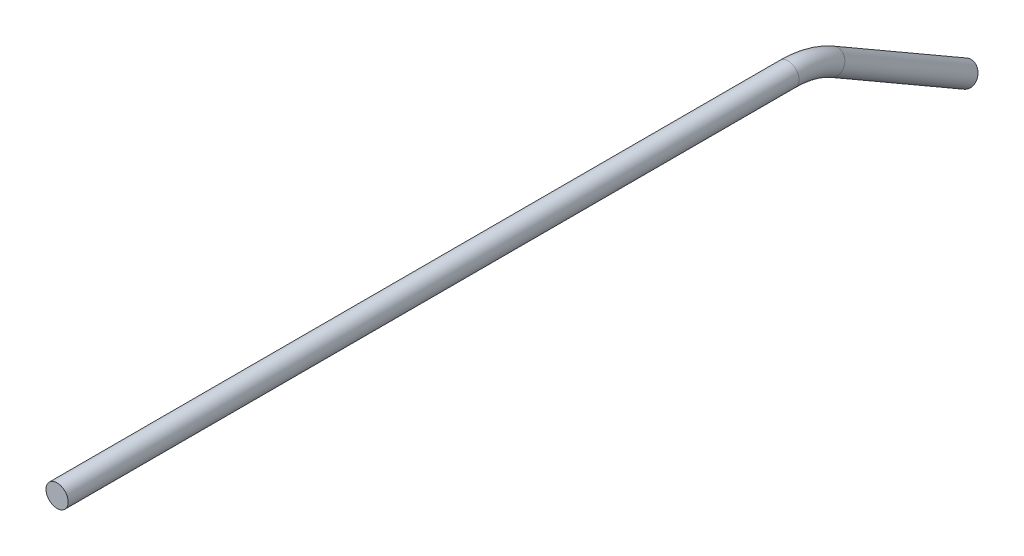
ISO-10303-21;
HEADER;
FILE_DESCRIPTION(('STEP AP214'),'2;1');
FILE_NAME('part.step','',(''),(''),'','','');
FILE_SCHEMA(('AUTOMOTIVE_DESIGN { 1 0 10303 214 1 1 1 1 }'));
ENDSEC;
DATA;
#1=APPLICATION_CONTEXT('core data for automotive mechanical design processes');
#2=APPLICATION_PROTOCOL_DEFINITION('international standard','automotive_design',2000,#1);
#3=PRODUCT_CONTEXT('',#1,'mechanical');
#4=PRODUCT('Part','Part','',(#3));
#5=PRODUCT_RELATED_PRODUCT_CATEGORY('part','',(#4));
#6=PRODUCT_DEFINITION_FORMATION('','',#4);
#7=PRODUCT_DEFINITION_CONTEXT('part definition',#1,'design');
#8=PRODUCT_DEFINITION('design','',#6,#7);
#9=PRODUCT_DEFINITION_SHAPE('','',#8);
#10=(LENGTH_UNIT() NAMED_UNIT(*) SI_UNIT(.MILLI.,.METRE.));
#11=(NAMED_UNIT(*) PLANE_ANGLE_UNIT() SI_UNIT($,.RADIAN.));
#12=(NAMED_UNIT(*) SI_UNIT($,.STERADIAN.) SOLID_ANGLE_UNIT());
#13=UNCERTAINTY_MEASURE_WITH_UNIT(LENGTH_MEASURE(1.E-05),#10,'distance_accuracy_value','');
#14=(GEOMETRIC_REPRESENTATION_CONTEXT(3) GLOBAL_UNCERTAINTY_ASSIGNED_CONTEXT((#13)) GLOBAL_UNIT_ASSIGNED_CONTEXT((#10,
#11,#12)) REPRESENTATION_CONTEXT('',''));
#15=CARTESIAN_POINT('',(0.,0.,0.));
#16=DIRECTION('',(0.,0.,1.));
#17=DIRECTION('',(1.,0.,0.));
#18=AXIS2_PLACEMENT_3D('',#15,#16,#17);
#19=CARTESIAN_POINT('',(0.,-3.40295474387527,-221.794090512249));
#20=DIRECTION('',(0.,-0.500000000000001,-0.866025403784438));
#21=DIRECTION('',(0.,0.866025403784438,-0.500000000000001));
#22=AXIS2_PLACEMENT_3D('',#19,#20,#21);
#23=CYLINDRICAL_SURFACE('',#22,3.175);
#24=CARTESIAN_POINT('',(0.,-3.40295474387527,-221.794090512249));
#25=DIRECTION('',(0.,0.500000000000001,0.866025403784438));
#26=DIRECTION('',(1.,0.,0.));
#27=AXIS2_PLACEMENT_3D('',#24,#25,#26);
#28=CIRCLE('',#27,3.175);
#29=CARTESIAN_POINT('',(0.,-0.653324086859676,-223.381590512249));
#30=VERTEX_POINT('',#29);
#31=EDGE_CURVE('E37',#30,#30,#28,.T.);
#32=ORIENTED_EDGE('',*,*,#31,.F.);
#33=EDGE_LOOP('',(#32));
#34=FACE_BOUND('',#33,.T.);
#35=CARTESIAN_POINT('',(0.,-25.4,-259.894090512249));
#36=DIRECTION('',(0.,0.500000000000001,0.866025403784438));
#37=DIRECTION('',(1.,0.,0.));
#38=AXIS2_PLACEMENT_3D('',#35,#36,#37);
#39=CIRCLE('',#38,3.175);
#40=CARTESIAN_POINT('',(3.175,-25.4,-259.894090512249));
#41=VERTEX_POINT('',#40);
#42=EDGE_CURVE('E10',#41,#41,#39,.T.);
#43=ORIENTED_EDGE('',*,*,#42,.T.);
#44=EDGE_LOOP('',(#43));
#45=FACE_BOUND('',#44,.T.);
#46=ADVANCED_FACE('F31',(#34,#45),#23,.T.);
#47=CARTESIAN_POINT('',(0.,-25.4,-209.094090512249));
#48=DIRECTION('',(-1.,0.,0.));
#49=DIRECTION('',(0.,0.,1.));
#50=AXIS2_PLACEMENT_3D('',#47,#48,#49);
#51=TOROIDAL_SURFACE('',#50,25.4,3.175);
#52=CARTESIAN_POINT('',(0.,0.,-209.094090512249));
#53=DIRECTION('',(0.,0.,1.));
#54=DIRECTION('',(1.,0.,0.));
#55=AXIS2_PLACEMENT_3D('',#52,#53,#54);
#56=CIRCLE('',#55,3.175);
#57=CARTESIAN_POINT('',(0.,3.175,-209.094090512249));
#58=VERTEX_POINT('',#57);
#59=EDGE_CURVE('E41',#58,#58,#56,.T.);
#60=CARTESIAN_POINT('',(0.,-25.4,-209.094090512249));
#61=DIRECTION('',(-1.,0.,0.));
#62=DIRECTION('',(0.,0.,1.));
#63=AXIS2_PLACEMENT_3D('',#60,#61,#62);
#64=CIRCLE('',#63,28.575);
#65=EDGE_CURVE('',#58,#30,#64,.T.);
#66=ORIENTED_EDGE('',*,*,#59,.F.);
#67=ORIENTED_EDGE('',*,*,#31,.T.);
#68=ORIENTED_EDGE('',*,*,#65,.T.);
#69=ORIENTED_EDGE('',*,*,#65,.F.);
#70=EDGE_LOOP('',(#66,#68,#67,#69));
#71=FACE_BOUND('',#70,.T.);
#72=ADVANCED_FACE('F56',(#71),#51,.T.);
#73=CARTESIAN_POINT('',(0.,0.,-209.094090512249));
#74=DIRECTION('',(0.,0.,1.));
#75=DIRECTION('',(1.,0.,0.));
#76=AXIS2_PLACEMENT_3D('',#73,#74,#75);
#77=CYLINDRICAL_SURFACE('',#76,3.175);
#78=ORIENTED_EDGE('',*,*,#59,.T.);
#79=EDGE_LOOP('',(#78));
#80=FACE_BOUND('',#79,.T.);
#81=CARTESIAN_POINT('',(0.,0.,0.));
#82=DIRECTION('',(0.,0.,1.));
#83=DIRECTION('',(1.,0.,0.));
#84=AXIS2_PLACEMENT_3D('',#81,#82,#83);
#85=CIRCLE('',#84,3.175);
#86=CARTESIAN_POINT('',(3.175,0.,0.));
#87=VERTEX_POINT('',#86);
#88=EDGE_CURVE('E45',#87,#87,#85,.T.);
#89=ORIENTED_EDGE('',*,*,#88,.F.);
#90=EDGE_LOOP('',(#89));
#91=FACE_BOUND('',#90,.T.);
#92=ADVANCED_FACE('F53',(#80,#91),#77,.T.);
#93=CARTESIAN_POINT('',(0.,-25.4,-259.894090512249));
#94=DIRECTION('',(0.,0.500000000000001,0.866025403784438));
#95=DIRECTION('',(1.,0.,0.));
#96=AXIS2_PLACEMENT_3D('',#93,#94,#95);
#97=PLANE('',#96);
#98=ORIENTED_EDGE('',*,*,#42,.F.);
#99=EDGE_LOOP('',(#98));
#100=FACE_BOUND('',#99,.T.);
#101=ADVANCED_FACE('F55',(#100),#97,.F.);
#102=CARTESIAN_POINT('',(0.,0.,0.));
#103=DIRECTION('',(0.,0.,1.));
#104=DIRECTION('',(1.,0.,0.));
#105=AXIS2_PLACEMENT_3D('',#102,#103,#104);
#106=PLANE('',#105);
#107=ORIENTED_EDGE('',*,*,#88,.T.);
#108=EDGE_LOOP('',(#107));
#109=FACE_BOUND('',#108,.T.);
#110=ADVANCED_FACE('F51',(#109),#106,.T.);
#111=CLOSED_SHELL('',(#46,#72,#92,#101,#110));
#112=MANIFOLD_SOLID_BREP('B2',#111);
#113=ADVANCED_BREP_SHAPE_REPRESENTATION('',(#18,#112),#14);
#114=SHAPE_DEFINITION_REPRESENTATION(#9,#113);
ENDSEC;
END-ISO-10303-21;
